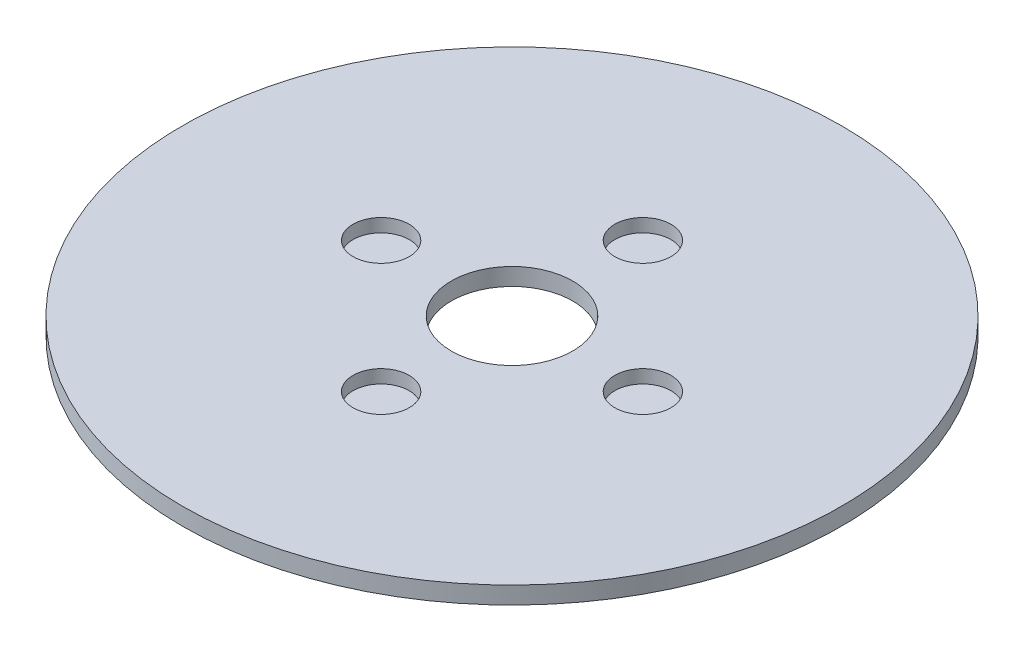
ISO-10303-21;
HEADER;
FILE_DESCRIPTION(('STEP AP214'),'2;1');
FILE_NAME('part.step','',(''),(''),'','','');
FILE_SCHEMA(('AUTOMOTIVE_DESIGN { 1 0 10303 214 1 1 1 1 }'));
ENDSEC;
DATA;
#1=APPLICATION_CONTEXT('core data for automotive mechanical design processes');
#2=APPLICATION_PROTOCOL_DEFINITION('international standard','automotive_design',2000,#1);
#3=PRODUCT_CONTEXT('',#1,'mechanical');
#4=PRODUCT('Part','Part','',(#3));
#5=PRODUCT_RELATED_PRODUCT_CATEGORY('part','',(#4));
#6=PRODUCT_DEFINITION_FORMATION('','',#4);
#7=PRODUCT_DEFINITION_CONTEXT('part definition',#1,'design');
#8=PRODUCT_DEFINITION('design','',#6,#7);
#9=PRODUCT_DEFINITION_SHAPE('','',#8);
#10=(LENGTH_UNIT() NAMED_UNIT(*) SI_UNIT(.MILLI.,.METRE.));
#11=(NAMED_UNIT(*) PLANE_ANGLE_UNIT() SI_UNIT($,.RADIAN.));
#12=(NAMED_UNIT(*) SI_UNIT($,.STERADIAN.) SOLID_ANGLE_UNIT());
#13=UNCERTAINTY_MEASURE_WITH_UNIT(LENGTH_MEASURE(1.E-05),#10,'distance_accuracy_value','');
#14=(GEOMETRIC_REPRESENTATION_CONTEXT(3) GLOBAL_UNCERTAINTY_ASSIGNED_CONTEXT((#13)) GLOBAL_UNIT_ASSIGNED_CONTEXT((#10,
#11,#12)) REPRESENTATION_CONTEXT('',''));
#15=CARTESIAN_POINT('',(0.,0.,0.));
#16=DIRECTION('',(0.,0.,1.));
#17=DIRECTION('',(1.,0.,0.));
#18=AXIS2_PLACEMENT_3D('',#15,#16,#17);
#19=CARTESIAN_POINT('',(0.,5.,0.));
#20=DIRECTION('',(0.,-1.,0.));
#21=DIRECTION('',(0.,0.,-1.));
#22=AXIS2_PLACEMENT_3D('',#19,#20,#21);
#23=CYLINDRICAL_SURFACE('',#22,95.);
#24=CARTESIAN_POINT('',(0.,5.,0.));
#25=DIRECTION('',(0.,1.,0.));
#26=DIRECTION('',(0.,0.,1.));
#27=AXIS2_PLACEMENT_3D('',#24,#25,#26);
#28=CIRCLE('',#27,95.);
#29=CARTESIAN_POINT('',(0.,5.,95.));
#30=VERTEX_POINT('',#29);
#31=EDGE_CURVE('E10',#30,#30,#28,.T.);
#32=ORIENTED_EDGE('',*,*,#31,.F.);
#33=EDGE_LOOP('',(#32));
#34=FACE_BOUND('',#33,.T.);
#35=CARTESIAN_POINT('',(0.,0.,0.));
#36=DIRECTION('',(0.,1.,0.));
#37=DIRECTION('',(0.,0.,1.));
#38=AXIS2_PLACEMENT_3D('',#35,#36,#37);
#39=CIRCLE('',#38,95.);
#40=CARTESIAN_POINT('',(0.,0.,95.));
#41=VERTEX_POINT('',#40);
#42=EDGE_CURVE('E37',#41,#41,#39,.T.);
#43=ORIENTED_EDGE('',*,*,#42,.T.);
#44=EDGE_LOOP('',(#43));
#45=FACE_BOUND('',#44,.T.);
#46=ADVANCED_FACE('F40',(#34,#45),#23,.T.);
#47=CARTESIAN_POINT('',(0.,5.,0.));
#48=DIRECTION('',(0.,1.,0.));
#49=DIRECTION('',(0.,0.,1.));
#50=AXIS2_PLACEMENT_3D('',#47,#48,#49);
#51=PLANE('',#50);
#52=CARTESIAN_POINT('',(1.31724256794177E-13,5.,37.7273266016717));
#53=DIRECTION('',(0.,1.,0.));
#54=DIRECTION('',(1.,0.,0.));
#55=AXIS2_PLACEMENT_3D('',#52,#53,#54);
#56=CIRCLE('',#55,8.093978679513);
#57=CARTESIAN_POINT('',(8.09397867951313,5.,37.7273266016717));
#58=VERTEX_POINT('',#57);
#59=EDGE_CURVE('E71',#58,#58,#56,.T.);
#60=ORIENTED_EDGE('',*,*,#59,.F.);
#61=EDGE_LOOP('',(#60));
#62=FACE_BOUND('',#61,.T.);
#63=CARTESIAN_POINT('',(37.7273266016717,5.,0.));
#64=DIRECTION('',(0.,1.,0.));
#65=DIRECTION('',(0.,0.,-1.));
#66=AXIS2_PLACEMENT_3D('',#63,#64,#65);
#67=CIRCLE('',#66,8.093978679513);
#68=CARTESIAN_POINT('',(37.7273266016717,5.,-8.093978679513));
#69=VERTEX_POINT('',#68);
#70=EDGE_CURVE('E70',#69,#69,#67,.T.);
#71=ORIENTED_EDGE('',*,*,#70,.F.);
#72=EDGE_LOOP('',(#71));
#73=FACE_BOUND('',#72,.T.);
#74=CARTESIAN_POINT('',(-3.95172770382531E-13,5.,-37.7273266016717));
#75=DIRECTION('',(0.,1.,0.));
#76=DIRECTION('',(-1.,0.,0.));
#77=AXIS2_PLACEMENT_3D('',#74,#75,#76);
#78=CIRCLE('',#77,8.093978679513);
#79=CARTESIAN_POINT('',(-8.09397867951339,5.,-37.7273266016716));
#80=VERTEX_POINT('',#79);
#81=EDGE_CURVE('E61',#80,#80,#78,.T.);
#82=ORIENTED_EDGE('',*,*,#81,.F.);
#83=EDGE_LOOP('',(#82));
#84=FACE_BOUND('',#83,.T.);
#85=CARTESIAN_POINT('',(-37.7273266016717,5.,0.));
#86=DIRECTION('',(0.,1.,0.));
#87=DIRECTION('',(0.,0.,1.));
#88=AXIS2_PLACEMENT_3D('',#85,#86,#87);
#89=CIRCLE('',#88,8.093978679513);
#90=CARTESIAN_POINT('',(-37.7273266016717,5.,8.093978679513));
#91=VERTEX_POINT('',#90);
#92=EDGE_CURVE('E54',#91,#91,#89,.T.);
#93=ORIENTED_EDGE('',*,*,#92,.F.);
#94=EDGE_LOOP('',(#93));
#95=FACE_BOUND('',#94,.T.);
#96=CARTESIAN_POINT('',(0.,5.,0.));
#97=DIRECTION('',(0.,1.,0.));
#98=DIRECTION('',(0.,0.,1.));
#99=AXIS2_PLACEMENT_3D('',#96,#97,#98);
#100=CIRCLE('',#99,17.5);
#101=CARTESIAN_POINT('',(0.,5.,17.5));
#102=VERTEX_POINT('',#101);
#103=EDGE_CURVE('E50',#102,#102,#100,.T.);
#104=ORIENTED_EDGE('',*,*,#103,.F.);
#105=EDGE_LOOP('',(#104));
#106=FACE_BOUND('',#105,.T.);
#107=ORIENTED_EDGE('',*,*,#31,.T.);
#108=EDGE_LOOP('',(#107));
#109=FACE_BOUND('',#108,.T.);
#110=ADVANCED_FACE('F86',(#62,#73,#84,#95,#106,#109),#51,.T.);
#111=CARTESIAN_POINT('',(0.,0.,0.));
#112=DIRECTION('',(0.,1.,0.));
#113=DIRECTION('',(0.,0.,1.));
#114=AXIS2_PLACEMENT_3D('',#111,#112,#113);
#115=PLANE('',#114);
#116=CARTESIAN_POINT('',(0.,0.,0.));
#117=DIRECTION('',(0.,1.,0.));
#118=DIRECTION('',(0.,0.,1.));
#119=AXIS2_PLACEMENT_3D('',#116,#117,#118);
#120=CIRCLE('',#119,17.5);
#121=CARTESIAN_POINT('',(0.,0.,17.5));
#122=VERTEX_POINT('',#121);
#123=EDGE_CURVE('E47',#122,#122,#120,.T.);
#124=ORIENTED_EDGE('',*,*,#123,.T.);
#125=EDGE_LOOP('',(#124));
#126=FACE_BOUND('',#125,.T.);
#127=ORIENTED_EDGE('',*,*,#42,.F.);
#128=EDGE_LOOP('',(#127));
#129=FACE_BOUND('',#128,.T.);
#130=ADVANCED_FACE('F93',(#126,#129),#115,.F.);
#131=CARTESIAN_POINT('',(0.,5.,0.));
#132=DIRECTION('',(0.,-1.,0.));
#133=DIRECTION('',(0.,0.,-1.));
#134=AXIS2_PLACEMENT_3D('',#131,#132,#133);
#135=CYLINDRICAL_SURFACE('',#134,17.5);
#136=ORIENTED_EDGE('',*,*,#103,.T.);
#137=EDGE_LOOP('',(#136));
#138=FACE_BOUND('',#137,.T.);
#139=ORIENTED_EDGE('',*,*,#123,.F.);
#140=EDGE_LOOP('',(#139));
#141=FACE_BOUND('',#140,.T.);
#142=ADVANCED_FACE('F101',(#138,#141),#135,.F.);
#143=CARTESIAN_POINT('',(-37.7273266016717,1.16554177026129,0.));
#144=DIRECTION('',(0.,1.,0.));
#145=DIRECTION('',(0.,0.,1.));
#146=AXIS2_PLACEMENT_3D('',#143,#144,#145);
#147=CYLINDRICAL_SURFACE('',#146,8.093978679513);
#148=CARTESIAN_POINT('',(-37.7273266016717,1.16554177026129,0.));
#149=DIRECTION('',(0.,1.,0.));
#150=DIRECTION('',(0.,0.,1.));
#151=AXIS2_PLACEMENT_3D('',#148,#149,#150);
#152=CIRCLE('',#151,8.093978679513);
#153=CARTESIAN_POINT('',(-37.7273266016717,1.16554177026129,8.093978679513));
#154=VERTEX_POINT('',#153);
#155=EDGE_CURVE('E55',#154,#154,#152,.T.);
#156=ORIENTED_EDGE('',*,*,#155,.F.);
#157=EDGE_LOOP('',(#156));
#158=FACE_BOUND('',#157,.T.);
#159=ORIENTED_EDGE('',*,*,#92,.T.);
#160=EDGE_LOOP('',(#159));
#161=FACE_BOUND('',#160,.T.);
#162=ADVANCED_FACE('F102',(#158,#161),#147,.F.);
#163=CARTESIAN_POINT('',(-37.7273266016717,1.16554177026129,0.));
#164=DIRECTION('',(0.,1.,0.));
#165=DIRECTION('',(0.,0.,1.));
#166=AXIS2_PLACEMENT_3D('',#163,#164,#165);
#167=PLANE('',#166);
#168=ORIENTED_EDGE('',*,*,#155,.T.);
#169=EDGE_LOOP('',(#168));
#170=FACE_BOUND('',#169,.T.);
#171=ADVANCED_FACE('F133',(#170),#167,.T.);
#172=CARTESIAN_POINT('',(-3.95172770382531E-13,1.16554177026129,-37.7273266016717));
#173=DIRECTION('',(0.,1.,0.));
#174=DIRECTION('',(0.,0.,1.));
#175=AXIS2_PLACEMENT_3D('',#172,#173,#174);
#176=CYLINDRICAL_SURFACE('',#175,8.093978679513);
#177=CARTESIAN_POINT('',(-3.95172770382531E-13,1.16554177026129,-37.7273266016717));
#178=DIRECTION('',(0.,1.,0.));
#179=DIRECTION('',(-1.,0.,0.));
#180=AXIS2_PLACEMENT_3D('',#177,#178,#179);
#181=CIRCLE('',#180,8.093978679513);
#182=CARTESIAN_POINT('',(-8.09397867951339,1.16554177026129,-37.7273266016716));
#183=VERTEX_POINT('',#182);
#184=EDGE_CURVE('E63',#183,#183,#181,.T.);
#185=ORIENTED_EDGE('',*,*,#184,.F.);
#186=EDGE_LOOP('',(#185));
#187=FACE_BOUND('',#186,.T.);
#188=ORIENTED_EDGE('',*,*,#81,.T.);
#189=EDGE_LOOP('',(#188));
#190=FACE_BOUND('',#189,.T.);
#191=ADVANCED_FACE('F142',(#187,#190),#176,.F.);
#192=CARTESIAN_POINT('',(-3.95172770382531E-13,1.16554177026129,-37.7273266016717));
#193=DIRECTION('',(0.,1.,0.));
#194=DIRECTION('',(-1.,0.,0.));
#195=AXIS2_PLACEMENT_3D('',#192,#193,#194);
#196=PLANE('',#195);
#197=ORIENTED_EDGE('',*,*,#184,.T.);
#198=EDGE_LOOP('',(#197));
#199=FACE_BOUND('',#198,.T.);
#200=ADVANCED_FACE('F156',(#199),#196,.T.);
#201=CARTESIAN_POINT('',(37.7273266016717,1.16554177026129,0.));
#202=DIRECTION('',(0.,1.,0.));
#203=DIRECTION('',(0.,0.,1.));
#204=AXIS2_PLACEMENT_3D('',#201,#202,#203);
#205=CYLINDRICAL_SURFACE('',#204,8.093978679513);
#206=CARTESIAN_POINT('',(37.7273266016717,1.16554177026129,0.));
#207=DIRECTION('',(0.,1.,0.));
#208=DIRECTION('',(0.,0.,-1.));
#209=AXIS2_PLACEMENT_3D('',#206,#207,#208);
#210=CIRCLE('',#209,8.093978679513);
#211=CARTESIAN_POINT('',(37.7273266016717,1.16554177026129,-8.093978679513));
#212=VERTEX_POINT('',#211);
#213=EDGE_CURVE('E69',#212,#212,#210,.T.);
#214=ORIENTED_EDGE('',*,*,#213,.F.);
#215=EDGE_LOOP('',(#214));
#216=FACE_BOUND('',#215,.T.);
#217=ORIENTED_EDGE('',*,*,#70,.T.);
#218=EDGE_LOOP('',(#217));
#219=FACE_BOUND('',#218,.T.);
#220=ADVANCED_FACE('F164',(#216,#219),#205,.F.);
#221=CARTESIAN_POINT('',(37.7273266016717,1.16554177026129,0.));
#222=DIRECTION('',(0.,1.,0.));
#223=DIRECTION('',(0.,0.,-1.));
#224=AXIS2_PLACEMENT_3D('',#221,#222,#223);
#225=PLANE('',#224);
#226=ORIENTED_EDGE('',*,*,#213,.T.);
#227=EDGE_LOOP('',(#226));
#228=FACE_BOUND('',#227,.T.);
#229=ADVANCED_FACE('F83',(#228),#225,.T.);
#230=CARTESIAN_POINT('',(1.31724256794177E-13,1.16554177026129,37.7273266016717));
#231=DIRECTION('',(0.,1.,0.));
#232=DIRECTION('',(0.,0.,1.));
#233=AXIS2_PLACEMENT_3D('',#230,#231,#232);
#234=CYLINDRICAL_SURFACE('',#233,8.093978679513);
#235=CARTESIAN_POINT('',(1.31724256794177E-13,1.16554177026129,37.7273266016717));
#236=DIRECTION('',(0.,1.,0.));
#237=DIRECTION('',(1.,0.,0.));
#238=AXIS2_PLACEMENT_3D('',#235,#236,#237);
#239=CIRCLE('',#238,8.093978679513);
#240=CARTESIAN_POINT('',(8.09397867951313,1.16554177026129,37.7273266016717));
#241=VERTEX_POINT('',#240);
#242=EDGE_CURVE('E59',#241,#241,#239,.T.);
#243=ORIENTED_EDGE('',*,*,#242,.F.);
#244=EDGE_LOOP('',(#243));
#245=FACE_BOUND('',#244,.T.);
#246=ORIENTED_EDGE('',*,*,#59,.T.);
#247=EDGE_LOOP('',(#246));
#248=FACE_BOUND('',#247,.T.);
#249=ADVANCED_FACE('F81',(#245,#248),#234,.F.);
#250=CARTESIAN_POINT('',(1.31724256794177E-13,1.16554177026129,37.7273266016717));
#251=DIRECTION('',(0.,1.,0.));
#252=DIRECTION('',(1.,0.,0.));
#253=AXIS2_PLACEMENT_3D('',#250,#251,#252);
#254=PLANE('',#253);
#255=ORIENTED_EDGE('',*,*,#242,.T.);
#256=EDGE_LOOP('',(#255));
#257=FACE_BOUND('',#256,.T.);
#258=ADVANCED_FACE('F78',(#257),#254,.T.);
#259=CLOSED_SHELL('',(#46,#110,#130,#142,#162,#171,#191,#200,#220,#229,#249,#258));
#260=MANIFOLD_SOLID_BREP('B2',#259);
#261=ADVANCED_BREP_SHAPE_REPRESENTATION('',(#18,#260),#14);
#262=SHAPE_DEFINITION_REPRESENTATION(#9,#261);
ENDSEC;
END-ISO-10303-21;
